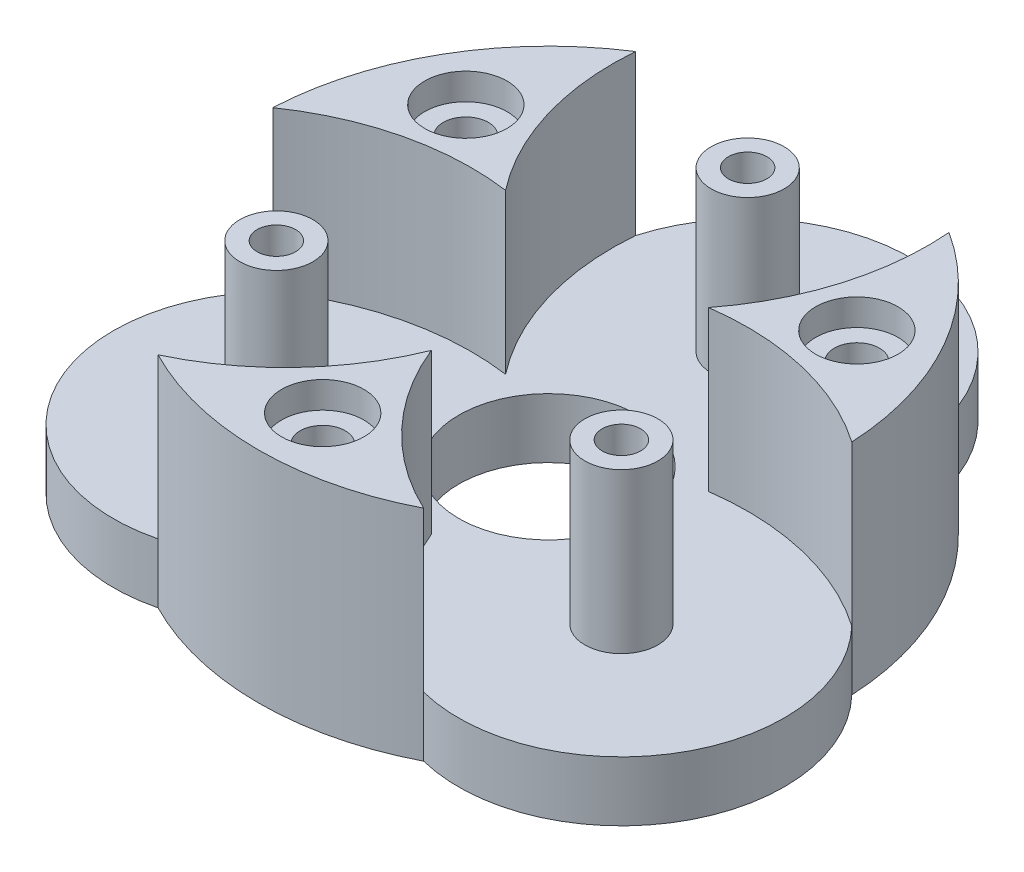
ISO-10303-21;
HEADER;
FILE_DESCRIPTION(('STEP AP214'),'2;1');
FILE_NAME('part.step','',(''),(''),'','','');
FILE_SCHEMA(('AUTOMOTIVE_DESIGN { 1 0 10303 214 1 1 1 1 }'));
ENDSEC;
DATA;
#1=APPLICATION_CONTEXT('core data for automotive mechanical design processes');
#2=APPLICATION_PROTOCOL_DEFINITION('international standard','automotive_design',2000,#1);
#3=PRODUCT_CONTEXT('',#1,'mechanical');
#4=PRODUCT('Part','Part','',(#3));
#5=PRODUCT_RELATED_PRODUCT_CATEGORY('part','',(#4));
#6=PRODUCT_DEFINITION_FORMATION('','',#4);
#7=PRODUCT_DEFINITION_CONTEXT('part definition',#1,'design');
#8=PRODUCT_DEFINITION('design','',#6,#7);
#9=PRODUCT_DEFINITION_SHAPE('','',#8);
#10=(LENGTH_UNIT() NAMED_UNIT(*) SI_UNIT(.MILLI.,.METRE.));
#11=(NAMED_UNIT(*) PLANE_ANGLE_UNIT() SI_UNIT($,.RADIAN.));
#12=(NAMED_UNIT(*) SI_UNIT($,.STERADIAN.) SOLID_ANGLE_UNIT());
#13=UNCERTAINTY_MEASURE_WITH_UNIT(LENGTH_MEASURE(1.E-05),#10,'distance_accuracy_value','');
#14=(GEOMETRIC_REPRESENTATION_CONTEXT(3) GLOBAL_UNCERTAINTY_ASSIGNED_CONTEXT((#13)) GLOBAL_UNIT_ASSIGNED_CONTEXT((#10,
#11,#12)) REPRESENTATION_CONTEXT('',''));
#15=CARTESIAN_POINT('',(0.,0.,0.));
#16=DIRECTION('',(0.,0.,1.));
#17=DIRECTION('',(1.,0.,0.));
#18=AXIS2_PLACEMENT_3D('',#15,#16,#17);
#19=CARTESIAN_POINT('',(-14.7224318643364,-4.80832611206852,-8.49999999999909));
#20=DIRECTION('',(0.,1.,0.));
#21=DIRECTION('',(0.,0.,1.));
#22=AXIS2_PLACEMENT_3D('',#19,#20,#21);
#23=CYLINDRICAL_SURFACE('',#22,1.7);
#24=CARTESIAN_POINT('',(-14.7224318643364,14.5,-8.49999999999909));
#25=DIRECTION('',(0.,1.,0.));
#26=DIRECTION('',(0.,0.,1.));
#27=AXIS2_PLACEMENT_3D('',#24,#25,#26);
#28=CIRCLE('',#27,1.7);
#29=CARTESIAN_POINT('',(-14.7224318643364,14.5,-6.79999999999909));
#30=VERTEX_POINT('',#29);
#31=EDGE_CURVE('E287',#30,#30,#28,.F.);
#32=ORIENTED_EDGE('',*,*,#31,.F.);
#33=EDGE_LOOP('',(#32));
#34=FACE_BOUND('',#33,.T.);
#35=CARTESIAN_POINT('',(-14.7224318643364,3.5,-8.49999999999909));
#36=DIRECTION('',(0.,-1.,0.));
#37=DIRECTION('',(0.,0.,-1.));
#38=AXIS2_PLACEMENT_3D('',#35,#36,#37);
#39=CIRCLE('',#38,1.7);
#40=CARTESIAN_POINT('',(-14.7224318643364,3.5,-10.1999999999991));
#41=VERTEX_POINT('',#40);
#42=EDGE_CURVE('E37',#41,#41,#39,.F.);
#43=ORIENTED_EDGE('',*,*,#42,.F.);
#44=EDGE_LOOP('',(#43));
#45=FACE_BOUND('',#44,.T.);
#46=ADVANCED_FACE('F33',(#34,#45),#23,.F.);
#47=CARTESIAN_POINT('',(14.7224318643351,-4.80832611206852,-8.50000000000133));
#48=DIRECTION('',(0.,1.,0.));
#49=DIRECTION('',(0.,0.,1.));
#50=AXIS2_PLACEMENT_3D('',#47,#48,#49);
#51=CYLINDRICAL_SURFACE('',#50,1.7);
#52=CARTESIAN_POINT('',(14.7224318643351,0.,-8.50000000000133));
#53=DIRECTION('',(0.,1.,0.));
#54=DIRECTION('',(0.,0.,1.));
#55=AXIS2_PLACEMENT_3D('',#52,#53,#54);
#56=CIRCLE('',#55,1.7);
#57=CARTESIAN_POINT('',(14.7224318643351,0.,-6.80000000000134));
#58=VERTEX_POINT('',#57);
#59=EDGE_CURVE('E180',#58,#58,#56,.F.);
#60=ORIENTED_EDGE('',*,*,#59,.T.);
#61=EDGE_LOOP('',(#60));
#62=FACE_BOUND('',#61,.T.);
#63=CARTESIAN_POINT('',(14.7224318643351,14.5,-8.50000000000133));
#64=DIRECTION('',(0.,1.,0.));
#65=DIRECTION('',(0.,0.,1.));
#66=AXIS2_PLACEMENT_3D('',#63,#64,#65);
#67=CIRCLE('',#66,1.7);
#68=CARTESIAN_POINT('',(14.7224318643351,14.5,-6.80000000000134));
#69=VERTEX_POINT('',#68);
#70=EDGE_CURVE('E284',#69,#69,#67,.F.);
#71=ORIENTED_EDGE('',*,*,#70,.F.);
#72=EDGE_LOOP('',(#71));
#73=FACE_BOUND('',#72,.T.);
#74=ADVANCED_FACE('F340',(#62,#73),#51,.F.);
#75=CARTESIAN_POINT('',(1.29150162786473E-12,-4.80832611206852,17.0000000000004));
#76=DIRECTION('',(0.,1.,0.));
#77=DIRECTION('',(0.,0.,1.));
#78=AXIS2_PLACEMENT_3D('',#75,#76,#77);
#79=CYLINDRICAL_SURFACE('',#78,1.7);
#80=CARTESIAN_POINT('',(1.29150162786473E-12,0.,17.0000000000004));
#81=DIRECTION('',(0.,1.,0.));
#82=DIRECTION('',(0.,0.,1.));
#83=AXIS2_PLACEMENT_3D('',#80,#81,#82);
#84=CIRCLE('',#83,1.7);
#85=CARTESIAN_POINT('',(1.29150162786473E-12,0.,18.7000000000004));
#86=VERTEX_POINT('',#85);
#87=EDGE_CURVE('E181',#86,#86,#84,.F.);
#88=ORIENTED_EDGE('',*,*,#87,.T.);
#89=EDGE_LOOP('',(#88));
#90=FACE_BOUND('',#89,.T.);
#91=CARTESIAN_POINT('',(1.29150162786473E-12,14.5,17.0000000000004));
#92=DIRECTION('',(0.,1.,0.));
#93=DIRECTION('',(0.,0.,1.));
#94=AXIS2_PLACEMENT_3D('',#91,#92,#93);
#95=CIRCLE('',#94,1.7);
#96=CARTESIAN_POINT('',(1.29150162786473E-12,14.5,18.7000000000004));
#97=VERTEX_POINT('',#96);
#98=EDGE_CURVE('E281',#97,#97,#95,.F.);
#99=ORIENTED_EDGE('',*,*,#98,.F.);
#100=EDGE_LOOP('',(#99));
#101=FACE_BOUND('',#100,.T.);
#102=ADVANCED_FACE('F348',(#90,#101),#79,.F.);
#103=CARTESIAN_POINT('',(0.,16.5,-15.));
#104=DIRECTION('',(0.,1.,0.));
#105=DIRECTION('',(0.,0.,1.));
#106=AXIS2_PLACEMENT_3D('',#103,#104,#105);
#107=CYLINDRICAL_SURFACE('',#106,1.45);
#108=CARTESIAN_POINT('',(0.,16.5,-15.));
#109=DIRECTION('',(0.,1.,0.));
#110=DIRECTION('',(0.,0.,1.));
#111=AXIS2_PLACEMENT_3D('',#108,#109,#110);
#112=CIRCLE('',#111,1.45);
#113=CARTESIAN_POINT('',(0.,16.5,-13.55));
#114=VERTEX_POINT('',#113);
#115=EDGE_CURVE('E177',#114,#114,#112,.T.);
#116=ORIENTED_EDGE('',*,*,#115,.T.);
#117=EDGE_LOOP('',(#116));
#118=FACE_BOUND('',#117,.T.);
#119=CARTESIAN_POINT('',(0.,2.2,-15.));
#120=DIRECTION('',(0.,-1.,0.));
#121=DIRECTION('',(0.,0.,-1.));
#122=AXIS2_PLACEMENT_3D('',#119,#120,#121);
#123=CIRCLE('',#122,1.45);
#124=CARTESIAN_POINT('',(0.,2.2,-16.45));
#125=VERTEX_POINT('',#124);
#126=EDGE_CURVE('E142',#125,#125,#123,.F.);
#127=ORIENTED_EDGE('',*,*,#126,.F.);
#128=EDGE_LOOP('',(#127));
#129=FACE_BOUND('',#128,.T.);
#130=ADVANCED_FACE('F525',(#118,#129),#107,.F.);
#131=CARTESIAN_POINT('',(-12.9903810567659,16.5,7.50000000000037));
#132=DIRECTION('',(0.,1.,0.));
#133=DIRECTION('',(0.,0.,1.));
#134=AXIS2_PLACEMENT_3D('',#131,#132,#133);
#135=CYLINDRICAL_SURFACE('',#134,1.45);
#136=CARTESIAN_POINT('',(-12.9903810567659,16.5,7.50000000000037));
#137=DIRECTION('',(0.,1.,0.));
#138=DIRECTION('',(0.,0.,1.));
#139=AXIS2_PLACEMENT_3D('',#136,#137,#138);
#140=CIRCLE('',#139,1.45);
#141=CARTESIAN_POINT('',(-12.9903810567659,16.5,8.95000000000037));
#142=VERTEX_POINT('',#141);
#143=EDGE_CURVE('E174',#142,#142,#140,.T.);
#144=ORIENTED_EDGE('',*,*,#143,.T.);
#145=EDGE_LOOP('',(#144));
#146=FACE_BOUND('',#145,.T.);
#147=CARTESIAN_POINT('',(-12.9903810567659,2.2,7.50000000000037));
#148=DIRECTION('',(0.,-1.,0.));
#149=DIRECTION('',(0.,0.,-1.));
#150=AXIS2_PLACEMENT_3D('',#147,#148,#149);
#151=CIRCLE('',#150,1.45);
#152=CARTESIAN_POINT('',(-12.9903810567659,2.2,6.05000000000038));
#153=VERTEX_POINT('',#152);
#154=EDGE_CURVE('E145',#153,#153,#151,.F.);
#155=ORIENTED_EDGE('',*,*,#154,.F.);
#156=EDGE_LOOP('',(#155));
#157=FACE_BOUND('',#156,.T.);
#158=ADVANCED_FACE('F530',(#146,#157),#135,.F.);
#159=CARTESIAN_POINT('',(12.9903810567672,16.5,7.49999999999963));
#160=DIRECTION('',(0.,1.,0.));
#161=DIRECTION('',(0.,0.,1.));
#162=AXIS2_PLACEMENT_3D('',#159,#160,#161);
#163=CYLINDRICAL_SURFACE('',#162,1.45);
#164=CARTESIAN_POINT('',(12.9903810567672,16.5,7.49999999999963));
#165=DIRECTION('',(0.,1.,0.));
#166=DIRECTION('',(0.,0.,1.));
#167=AXIS2_PLACEMENT_3D('',#164,#165,#166);
#168=CIRCLE('',#167,1.45);
#169=CARTESIAN_POINT('',(12.9903810567672,16.5,8.94999999999963));
#170=VERTEX_POINT('',#169);
#171=EDGE_CURVE('E171',#170,#170,#168,.T.);
#172=ORIENTED_EDGE('',*,*,#171,.T.);
#173=EDGE_LOOP('',(#172));
#174=FACE_BOUND('',#173,.T.);
#175=CARTESIAN_POINT('',(12.9903810567672,2.2,7.49999999999963));
#176=DIRECTION('',(0.,-1.,0.));
#177=DIRECTION('',(0.,0.,-1.));
#178=AXIS2_PLACEMENT_3D('',#175,#176,#177);
#179=CIRCLE('',#178,1.45);
#180=CARTESIAN_POINT('',(12.9903810567672,2.2,6.04999999999963));
#181=VERTEX_POINT('',#180);
#182=EDGE_CURVE('E275',#181,#181,#179,.F.);
#183=ORIENTED_EDGE('',*,*,#182,.F.);
#184=EDGE_LOOP('',(#183));
#185=FACE_BOUND('',#184,.T.);
#186=ADVANCED_FACE('F542',(#174,#185),#163,.F.);
#187=CARTESIAN_POINT('',(0.,4.5,0.));
#188=DIRECTION('',(0.,-1.,0.));
#189=DIRECTION('',(0.,0.,-1.));
#190=AXIS2_PLACEMENT_3D('',#187,#188,#189);
#191=CYLINDRICAL_SURFACE('',#190,21.825);
#192=CARTESIAN_POINT('',(0.,0.,0.));
#193=DIRECTION('',(0.,1.,0.));
#194=DIRECTION('',(0.,0.,1.));
#195=AXIS2_PLACEMENT_3D('',#192,#193,#194);
#196=CIRCLE('',#195,21.825);
#197=CARTESIAN_POINT('',(21.8002371635045,0.,-1.03936741095642));
#198=VERTEX_POINT('',#197);
#199=CARTESIAN_POINT('',(11.8002371635036,0.,-18.3598754866439));
#200=VERTEX_POINT('',#199);
#201=EDGE_CURVE('E42',#198,#200,#196,.T.);
#202=ORIENTED_EDGE('',*,*,#201,.T.);
#203=DIRECTION('',(0.,-1.,0.));
#204=VECTOR('',#203,1.);
#205=CARTESIAN_POINT('',(11.8002371635029,29.7261619064555,-18.3598754866443));
#206=LINE('',#205,#204);
#207=CARTESIAN_POINT('',(11.800237163503,4.5,-18.3598754866443));
#208=VERTEX_POINT('',#207);
#209=EDGE_CURVE('E141',#208,#200,#206,.T.);
#210=ORIENTED_EDGE('',*,*,#209,.F.);
#211=DIRECTION('',(0.,-1.,0.));
#212=VECTOR('',#211,1.);
#213=CARTESIAN_POINT('',(11.800237163503,38.8704400804743,-18.3598754866443));
#214=LINE('',#213,#212);
#215=CARTESIAN_POINT('',(11.800237163503,16.5,-18.3598754866443));
#216=VERTEX_POINT('',#215);
#217=EDGE_CURVE('E195',#216,#208,#214,.T.);
#218=ORIENTED_EDGE('',*,*,#217,.F.);
#219=CARTESIAN_POINT('',(0.,16.5,0.));
#220=DIRECTION('',(0.,1.,0.));
#221=DIRECTION('',(0.,0.,1.));
#222=AXIS2_PLACEMENT_3D('',#219,#220,#221);
#223=CIRCLE('',#222,21.825);
#224=CARTESIAN_POINT('',(21.8002371635045,16.5,-1.03936741095635));
#225=VERTEX_POINT('',#224);
#226=EDGE_CURVE('E200',#225,#216,#223,.T.);
#227=ORIENTED_EDGE('',*,*,#226,.F.);
#228=DIRECTION('',(0.,-1.,0.));
#229=VECTOR('',#228,1.);
#230=CARTESIAN_POINT('',(21.8002371635045,38.8704400804743,-1.03936741095636));
#231=LINE('',#230,#229);
#232=CARTESIAN_POINT('',(21.8002371635045,4.5,-1.03936741095635));
#233=VERTEX_POINT('',#232);
#234=EDGE_CURVE('E184',#225,#233,#231,.T.);
#235=ORIENTED_EDGE('',*,*,#234,.T.);
#236=DIRECTION('',(0.,-1.,0.));
#237=VECTOR('',#236,1.);
#238=CARTESIAN_POINT('',(21.8002371635045,30.3041566652598,-1.03936741095642));
#239=LINE('',#238,#237);
#240=EDGE_CURVE('E156',#233,#198,#239,.T.);
#241=ORIENTED_EDGE('',*,*,#240,.T.);
#242=EDGE_LOOP('',(#202,#210,#218,#227,#235,#241));
#243=FACE_BOUND('',#242,.T.);
#244=ADVANCED_FACE('F405',(#243),#191,.T.);
#245=CARTESIAN_POINT('',(-9.99999999999841,0.,19.3992428975987));
#246=VERTEX_POINT('',#245);
#247=CARTESIAN_POINT('',(10.0000000000009,0.,19.3992428975974));
#248=VERTEX_POINT('',#247);
#249=EDGE_CURVE('E11',#246,#248,#196,.T.);
#250=ORIENTED_EDGE('',*,*,#249,.T.);
#251=DIRECTION('',(0.,-1.,0.));
#252=VECTOR('',#251,1.);
#253=CARTESIAN_POINT('',(10.0000000000016,30.3041566652598,19.399242897597));
#254=LINE('',#253,#252);
#255=CARTESIAN_POINT('',(10.0000000000016,4.5,19.399242897597));
#256=VERTEX_POINT('',#255);
#257=EDGE_CURVE('E160',#256,#248,#254,.T.);
#258=ORIENTED_EDGE('',*,*,#257,.F.);
#259=DIRECTION('',(0.,-1.,0.));
#260=VECTOR('',#259,1.);
#261=CARTESIAN_POINT('',(10.0000000000016,40.3537208837531,19.399242897597));
#262=LINE('',#261,#260);
#263=CARTESIAN_POINT('',(10.0000000000016,16.5,19.399242897597));
#264=VERTEX_POINT('',#263);
#265=EDGE_CURVE('E218',#264,#256,#262,.T.);
#266=ORIENTED_EDGE('',*,*,#265,.F.);
#267=CARTESIAN_POINT('',(0.,16.5,0.));
#268=DIRECTION('',(0.,1.,0.));
#269=DIRECTION('',(0.,0.,1.));
#270=AXIS2_PLACEMENT_3D('',#267,#268,#269);
#271=CIRCLE('',#270,21.825);
#272=CARTESIAN_POINT('',(-9.99999999999842,16.5,19.3992428975986));
#273=VERTEX_POINT('',#272);
#274=EDGE_CURVE('E222',#273,#264,#271,.T.);
#275=ORIENTED_EDGE('',*,*,#274,.F.);
#276=DIRECTION('',(0.,-1.,0.));
#277=VECTOR('',#276,1.);
#278=CARTESIAN_POINT('',(-9.99999999999842,40.3537208837531,19.3992428975987));
#279=LINE('',#278,#277);
#280=CARTESIAN_POINT('',(-9.99999999999842,4.5,19.3992428975987));
#281=VERTEX_POINT('',#280);
#282=EDGE_CURVE('E199',#273,#281,#279,.T.);
#283=ORIENTED_EDGE('',*,*,#282,.T.);
#284=DIRECTION('',(0.,-1.,0.));
#285=VECTOR('',#284,1.);
#286=CARTESIAN_POINT('',(-9.99999999999841,30.3041566652593,19.3992428975987));
#287=LINE('',#286,#285);
#288=EDGE_CURVE('E164',#281,#246,#287,.T.);
#289=ORIENTED_EDGE('',*,*,#288,.T.);
#290=EDGE_LOOP('',(#250,#258,#266,#275,#283,#289));
#291=FACE_BOUND('',#290,.T.);
#292=ADVANCED_FACE('F398',(#291),#191,.T.);
#293=CARTESIAN_POINT('',(0.,4.5,0.));
#294=DIRECTION('',(0.,1.,0.));
#295=DIRECTION('',(0.,0.,1.));
#296=AXIS2_PLACEMENT_3D('',#293,#294,#295);
#297=PLANE('',#296);
#298=CARTESIAN_POINT('',(0.,4.5,0.));
#299=DIRECTION('',(0.,1.,0.));
#300=DIRECTION('',(0.,0.,1.));
#301=AXIS2_PLACEMENT_3D('',#298,#299,#300);
#302=CIRCLE('',#301,6.75);
#303=CARTESIAN_POINT('',(0.,4.5,6.75));
#304=VERTEX_POINT('',#303);
#305=EDGE_CURVE('E242',#304,#304,#302,.T.);
#306=ORIENTED_EDGE('',*,*,#305,.F.);
#307=EDGE_LOOP('',(#306));
#308=FACE_BOUND('',#307,.T.);
#309=CARTESIAN_POINT('',(-12.9903810567659,4.5,7.50000000000037));
#310=DIRECTION('',(0.,1.,0.));
#311=DIRECTION('',(0.,0.,1.));
#312=AXIS2_PLACEMENT_3D('',#309,#310,#311);
#313=CIRCLE('',#312,2.75);
#314=CARTESIAN_POINT('',(-12.9903810567659,4.5,10.2500000000004));
#315=VERTEX_POINT('',#314);
#316=EDGE_CURVE('E258',#315,#315,#313,.T.);
#317=ORIENTED_EDGE('',*,*,#316,.F.);
#318=EDGE_LOOP('',(#317));
#319=FACE_BOUND('',#318,.T.);
#320=CARTESIAN_POINT('',(12.9903810567672,4.5,7.49999999999963));
#321=DIRECTION('',(0.,1.,0.));
#322=DIRECTION('',(0.,0.,1.));
#323=AXIS2_PLACEMENT_3D('',#320,#321,#322);
#324=CIRCLE('',#323,2.75);
#325=CARTESIAN_POINT('',(12.9903810567672,4.5,10.2499999999996));
#326=VERTEX_POINT('',#325);
#327=EDGE_CURVE('E262',#326,#326,#324,.T.);
#328=ORIENTED_EDGE('',*,*,#327,.F.);
#329=EDGE_LOOP('',(#328));
#330=FACE_BOUND('',#329,.T.);
#331=CARTESIAN_POINT('',(0.,4.5,-15.));
#332=DIRECTION('',(0.,1.,0.));
#333=DIRECTION('',(0.,0.,1.));
#334=AXIS2_PLACEMENT_3D('',#331,#332,#333);
#335=CIRCLE('',#334,2.75);
#336=CARTESIAN_POINT('',(0.,4.5,-12.25));
#337=VERTEX_POINT('',#336);
#338=EDGE_CURVE('E268',#337,#337,#335,.T.);
#339=ORIENTED_EDGE('',*,*,#338,.F.);
#340=EDGE_LOOP('',(#339));
#341=FACE_BOUND('',#340,.T.);
#342=CARTESIAN_POINT('',(10.4048257460099,4.5,15.3916345964232));
#343=DIRECTION('',(0.,-1.,0.));
#344=DIRECTION('',(0.866025403784441,0.,0.499999999999997));
#345=AXIS2_PLACEMENT_3D('',#342,#343,#344);
#346=CIRCLE('',#345,19.9958302738465);
#347=CARTESIAN_POINT('',(7.64267418839752,4.5,-4.41250000000025));
#348=VERTEX_POINT('',#347);
#349=EDGE_CURVE('E187',#348,#233,#346,.T.);
#350=ORIENTED_EDGE('',*,*,#349,.F.);
#351=CARTESIAN_POINT('',(-8.12713369326764,4.5,-16.706660716204));
#352=DIRECTION('',(0.,-1.,0.));
#353=DIRECTION('',(-0.866025403784441,0.,-0.499999999999997));
#354=AXIS2_PLACEMENT_3D('',#351,#352,#353);
#355=CIRCLE('',#354,19.9958302738465);
#356=EDGE_CURVE('E192',#208,#348,#355,.T.);
#357=ORIENTED_EDGE('',*,*,#356,.F.);
#358=CARTESIAN_POINT('',(-7.84095011141517E-13,4.5,-14.9999999999996));
#359=DIRECTION('',(0.,1.,0.));
#360=DIRECTION('',(0.,0.,1.));
#361=AXIS2_PLACEMENT_3D('',#358,#359,#360);
#362=CIRCLE('',#361,12.2692444918464);
#363=CARTESIAN_POINT('',(-11.800237163506,4.5,-18.3598754866424));
#364=VERTEX_POINT('',#363);
#365=EDGE_CURVE('E138',#364,#208,#362,.F.);
#366=ORIENTED_EDGE('',*,*,#365,.F.);
#367=CARTESIAN_POINT('',(8.12713369326501,4.5,-16.7066607162065));
#368=DIRECTION('',(0.,-1.,0.));
#369=DIRECTION('',(0.,0.,-1.));
#370=AXIS2_PLACEMENT_3D('',#367,#368,#369);
#371=CIRCLE('',#370,19.9958302738465);
#372=CARTESIAN_POINT('',(-7.64267418839779,4.5,-4.41249999999977));
#373=VERTEX_POINT('',#372);
#374=EDGE_CURVE('E232',#373,#364,#371,.T.);
#375=ORIENTED_EDGE('',*,*,#374,.F.);
#376=CARTESIAN_POINT('',(-10.4048257460064,4.5,15.3916345964242));
#377=DIRECTION('',(0.,-1.,0.));
#378=DIRECTION('',(0.,0.,1.));
#379=AXIS2_PLACEMENT_3D('',#376,#377,#378);
#380=CIRCLE('',#379,19.9958302738465);
#381=CARTESIAN_POINT('',(-21.8002371635047,4.5,-1.0393674109528));
#382=VERTEX_POINT('',#381);
#383=EDGE_CURVE('E236',#382,#373,#380,.T.);
#384=ORIENTED_EDGE('',*,*,#383,.F.);
#385=CARTESIAN_POINT('',(-12.9903810567659,4.5,7.50000000000037));
#386=DIRECTION('',(0.,1.,0.));
#387=DIRECTION('',(0.,0.,1.));
#388=AXIS2_PLACEMENT_3D('',#385,#386,#387);
#389=CIRCLE('',#388,12.2692444918464);
#390=EDGE_CURVE('E165',#281,#382,#389,.F.);
#391=ORIENTED_EDGE('',*,*,#390,.F.);
#392=CARTESIAN_POINT('',(-18.5319594392749,4.5,1.31502611978334));
#393=DIRECTION('',(0.,-1.,0.));
#394=DIRECTION('',(-0.866025403784438,0.,0.500000000000002));
#395=AXIS2_PLACEMENT_3D('',#392,#393,#394);
#396=CIRCLE('',#395,19.9958302738465);
#397=CARTESIAN_POINT('',(2.74086309204336E-13,4.5,8.825));
#398=VERTEX_POINT('',#397);
#399=EDGE_CURVE('E210',#398,#281,#396,.T.);
#400=ORIENTED_EDGE('',*,*,#399,.F.);
#401=CARTESIAN_POINT('',(18.531959439274,4.5,1.3150261197798));
#402=DIRECTION('',(0.,-1.,0.));
#403=DIRECTION('',(0.866025403784438,0.,-0.500000000000002));
#404=AXIS2_PLACEMENT_3D('',#401,#402,#403);
#405=CIRCLE('',#404,19.9958302738465);
#406=EDGE_CURVE('E215',#256,#398,#405,.T.);
#407=ORIENTED_EDGE('',*,*,#406,.F.);
#408=CARTESIAN_POINT('',(12.9903810567666,4.5,7.4999999999992));
#409=DIRECTION('',(0.,1.,0.));
#410=DIRECTION('',(0.,0.,1.));
#411=AXIS2_PLACEMENT_3D('',#408,#409,#410);
#412=CIRCLE('',#411,12.2692444918464);
#413=EDGE_CURVE('E157',#233,#256,#412,.F.);
#414=ORIENTED_EDGE('',*,*,#413,.F.);
#415=EDGE_LOOP('',(#350,#357,#366,#375,#384,#391,#400,#407,#414));
#416=FACE_BOUND('',#415,.T.);
#417=ADVANCED_FACE('F396',(#308,#319,#330,#341,#416),#297,.T.);
#418=DIRECTION('',(0.,-1.,0.));
#419=VECTOR('',#418,1.);
#420=CARTESIAN_POINT('',(-11.800237163506,38.8704400804755,-18.3598754866424));
#421=LINE('',#420,#419);
#422=CARTESIAN_POINT('',(-11.800237163506,16.5,-18.3598754866424));
#423=VERTEX_POINT('',#422);
#424=EDGE_CURVE('E134',#423,#364,#421,.T.);
#425=ORIENTED_EDGE('',*,*,#424,.T.);
#426=DIRECTION('',(0.,-1.,0.));
#427=VECTOR('',#426,1.);
#428=CARTESIAN_POINT('',(-11.8002371635062,29.7261619064555,-18.3598754866422));
#429=LINE('',#428,#427);
#430=CARTESIAN_POINT('',(-11.8002371635062,0.,-18.3598754866422));
#431=VERTEX_POINT('',#430);
#432=EDGE_CURVE('E132',#364,#431,#429,.T.);
#433=ORIENTED_EDGE('',*,*,#432,.T.);
#434=CARTESIAN_POINT('',(-21.8002371635046,0.,-1.03936741095362));
#435=VERTEX_POINT('',#434);
#436=EDGE_CURVE('E44',#431,#435,#196,.T.);
#437=ORIENTED_EDGE('',*,*,#436,.T.);
#438=DIRECTION('',(0.,-1.,0.));
#439=VECTOR('',#438,1.);
#440=CARTESIAN_POINT('',(-21.8002371635047,30.3041566652593,-1.0393674109528));
#441=LINE('',#440,#439);
#442=EDGE_CURVE('E168',#382,#435,#441,.T.);
#443=ORIENTED_EDGE('',*,*,#442,.F.);
#444=DIRECTION('',(0.,-1.,0.));
#445=VECTOR('',#444,1.);
#446=CARTESIAN_POINT('',(-21.8002371635047,38.8704400804755,-1.0393674109528));
#447=LINE('',#446,#445);
#448=CARTESIAN_POINT('',(-21.8002371635047,16.5,-1.0393674109528));
#449=VERTEX_POINT('',#448);
#450=EDGE_CURVE('E238',#449,#382,#447,.T.);
#451=ORIENTED_EDGE('',*,*,#450,.F.);
#452=CARTESIAN_POINT('',(0.,16.5,0.));
#453=DIRECTION('',(0.,1.,0.));
#454=DIRECTION('',(0.,0.,1.));
#455=AXIS2_PLACEMENT_3D('',#452,#453,#454);
#456=CIRCLE('',#455,21.825);
#457=EDGE_CURVE('E243',#423,#449,#456,.T.);
#458=ORIENTED_EDGE('',*,*,#457,.F.);
#459=EDGE_LOOP('',(#425,#433,#437,#443,#451,#458));
#460=FACE_BOUND('',#459,.T.);
#461=ADVANCED_FACE('F35',(#460),#191,.T.);
#462=CARTESIAN_POINT('',(0.,0.,0.));
#463=DIRECTION('',(0.,1.,0.));
#464=DIRECTION('',(0.,0.,1.));
#465=AXIS2_PLACEMENT_3D('',#462,#463,#464);
#466=PLANE('',#465);
#467=CARTESIAN_POINT('',(-14.7224318643364,0.,-8.49999999999909));
#468=DIRECTION('',(0.,-1.,0.));
#469=DIRECTION('',(0.,0.,-1.));
#470=AXIS2_PLACEMENT_3D('',#467,#468,#469);
#471=CIRCLE('',#470,3.1);
#472=CARTESIAN_POINT('',(-14.7224318643364,0.,-11.5999999999991));
#473=VERTEX_POINT('',#472);
#474=EDGE_CURVE('E327',#473,#473,#471,.T.);
#475=ORIENTED_EDGE('',*,*,#474,.F.);
#476=EDGE_LOOP('',(#475));
#477=FACE_BOUND('',#476,.T.);
#478=CARTESIAN_POINT('',(-12.9903810567659,0.,7.50000000000037));
#479=DIRECTION('',(0.,-1.,0.));
#480=DIRECTION('',(0.,0.,-1.));
#481=AXIS2_PLACEMENT_3D('',#478,#479,#480);
#482=CIRCLE('',#481,2.875);
#483=CARTESIAN_POINT('',(-12.9903810567659,0.,4.62500000000037));
#484=VERTEX_POINT('',#483);
#485=EDGE_CURVE('E305',#484,#484,#482,.T.);
#486=ORIENTED_EDGE('',*,*,#485,.F.);
#487=EDGE_LOOP('',(#486));
#488=FACE_BOUND('',#487,.T.);
#489=CARTESIAN_POINT('',(12.9903810567666,0.,7.50000000000037));
#490=DIRECTION('',(0.,-1.,0.));
#491=DIRECTION('',(0.,0.,-1.));
#492=AXIS2_PLACEMENT_3D('',#489,#490,#491);
#493=CIRCLE('',#492,2.87500000000113);
#494=CARTESIAN_POINT('',(12.9903810567666,0.,4.62499999999924));
#495=VERTEX_POINT('',#494);
#496=EDGE_CURVE('E296',#495,#495,#493,.T.);
#497=ORIENTED_EDGE('',*,*,#496,.F.);
#498=EDGE_LOOP('',(#497));
#499=FACE_BOUND('',#498,.T.);
#500=CARTESIAN_POINT('',(3.19241253223778E-13,0.,-14.9999999999991));
#501=DIRECTION('',(0.,-1.,0.));
#502=DIRECTION('',(0.,0.,-1.));
#503=AXIS2_PLACEMENT_3D('',#500,#501,#502);
#504=CIRCLE('',#503,2.87500000000044);
#505=CARTESIAN_POINT('',(3.19241253223778E-13,0.,-17.8749999999995));
#506=VERTEX_POINT('',#505);
#507=EDGE_CURVE('E149',#506,#506,#504,.T.);
#508=ORIENTED_EDGE('',*,*,#507,.F.);
#509=EDGE_LOOP('',(#508));
#510=FACE_BOUND('',#509,.T.);
#511=ORIENTED_EDGE('',*,*,#87,.F.);
#512=EDGE_LOOP('',(#511));
#513=FACE_BOUND('',#512,.T.);
#514=ORIENTED_EDGE('',*,*,#59,.F.);
#515=EDGE_LOOP('',(#514));
#516=FACE_BOUND('',#515,.T.);
#517=CARTESIAN_POINT('',(0.,0.,0.));
#518=DIRECTION('',(0.,1.,0.));
#519=DIRECTION('',(0.,0.,1.));
#520=AXIS2_PLACEMENT_3D('',#517,#518,#519);
#521=CIRCLE('',#520,6.75);
#522=CARTESIAN_POINT('',(0.,0.,6.75));
#523=VERTEX_POINT('',#522);
#524=EDGE_CURVE('E255',#523,#523,#521,.T.);
#525=ORIENTED_EDGE('',*,*,#524,.T.);
#526=EDGE_LOOP('',(#525));
#527=FACE_BOUND('',#526,.T.);
#528=ORIENTED_EDGE('',*,*,#249,.F.);
#529=CARTESIAN_POINT('',(-12.9903810567659,0.,7.50000000000037));
#530=DIRECTION('',(0.,-1.,0.));
#531=DIRECTION('',(0.,0.,1.));
#532=AXIS2_PLACEMENT_3D('',#529,#530,#531);
#533=CIRCLE('',#532,12.2692444918464);
#534=EDGE_CURVE('E127',#246,#435,#533,.T.);
#535=ORIENTED_EDGE('',*,*,#534,.T.);
#536=ORIENTED_EDGE('',*,*,#436,.F.);
#537=CARTESIAN_POINT('',(-7.84095011141517E-13,0.,-14.9999999999996));
#538=DIRECTION('',(0.,-1.,0.));
#539=DIRECTION('',(-0.866025403784443,0.,-0.499999999999992));
#540=AXIS2_PLACEMENT_3D('',#537,#538,#539);
#541=CIRCLE('',#540,12.2692444918464);
#542=EDGE_CURVE('E125',#431,#200,#541,.T.);
#543=ORIENTED_EDGE('',*,*,#542,.T.);
#544=ORIENTED_EDGE('',*,*,#201,.F.);
#545=CARTESIAN_POINT('',(12.9903810567666,0.,7.4999999999992));
#546=DIRECTION('',(0.,-1.,0.));
#547=DIRECTION('',(0.866025403784436,0.,-0.500000000000004));
#548=AXIS2_PLACEMENT_3D('',#545,#546,#547);
#549=CIRCLE('',#548,12.2692444918464);
#550=EDGE_CURVE('E153',#198,#248,#549,.T.);
#551=ORIENTED_EDGE('',*,*,#550,.T.);
#552=EDGE_LOOP('',(#528,#535,#536,#543,#544,#551));
#553=FACE_BOUND('',#552,.T.);
#554=ADVANCED_FACE('F123',(#477,#488,#499,#510,#513,#516,#527,#553),#466,.F.);
#555=CARTESIAN_POINT('',(0.,16.5,-15.));
#556=DIRECTION('',(0.,-1.,0.));
#557=DIRECTION('',(0.,0.,-1.));
#558=AXIS2_PLACEMENT_3D('',#555,#556,#557);
#559=CYLINDRICAL_SURFACE('',#558,2.75);
#560=CARTESIAN_POINT('',(0.,16.5,-15.));
#561=DIRECTION('',(0.,1.,0.));
#562=DIRECTION('',(0.,0.,1.));
#563=AXIS2_PLACEMENT_3D('',#560,#561,#562);
#564=CIRCLE('',#563,2.75);
#565=CARTESIAN_POINT('',(0.,16.5,-12.25));
#566=VERTEX_POINT('',#565);
#567=EDGE_CURVE('E130',#566,#566,#564,.T.);
#568=ORIENTED_EDGE('',*,*,#567,.F.);
#569=EDGE_LOOP('',(#568));
#570=FACE_BOUND('',#569,.T.);
#571=ORIENTED_EDGE('',*,*,#338,.T.);
#572=EDGE_LOOP('',(#571));
#573=FACE_BOUND('',#572,.T.);
#574=ADVANCED_FACE('F391',(#570,#573),#559,.T.);
#575=CARTESIAN_POINT('',(0.,16.5,-15.));
#576=DIRECTION('',(0.,1.,0.));
#577=DIRECTION('',(0.,0.,1.));
#578=AXIS2_PLACEMENT_3D('',#575,#576,#577);
#579=PLANE('',#578);
#580=ORIENTED_EDGE('',*,*,#115,.F.);
#581=EDGE_LOOP('',(#580));
#582=FACE_BOUND('',#581,.T.);
#583=ORIENTED_EDGE('',*,*,#567,.T.);
#584=EDGE_LOOP('',(#583));
#585=FACE_BOUND('',#584,.T.);
#586=ADVANCED_FACE('F387',(#582,#585),#579,.T.);
#587=CARTESIAN_POINT('',(12.9903810567672,16.5,7.49999999999963));
#588=DIRECTION('',(0.,-1.,0.));
#589=DIRECTION('',(0.,0.,-1.));
#590=AXIS2_PLACEMENT_3D('',#587,#588,#589);
#591=CYLINDRICAL_SURFACE('',#590,2.75);
#592=CARTESIAN_POINT('',(12.9903810567672,16.5,7.49999999999963));
#593=DIRECTION('',(0.,1.,0.));
#594=DIRECTION('',(0.,0.,1.));
#595=AXIS2_PLACEMENT_3D('',#592,#593,#594);
#596=CIRCLE('',#595,2.75);
#597=CARTESIAN_POINT('',(12.9903810567672,16.5,10.2499999999996));
#598=VERTEX_POINT('',#597);
#599=EDGE_CURVE('E265',#598,#598,#596,.T.);
#600=ORIENTED_EDGE('',*,*,#599,.F.);
#601=EDGE_LOOP('',(#600));
#602=FACE_BOUND('',#601,.T.);
#603=ORIENTED_EDGE('',*,*,#327,.T.);
#604=EDGE_LOOP('',(#603));
#605=FACE_BOUND('',#604,.T.);
#606=ADVANCED_FACE('F383',(#602,#605),#591,.T.);
#607=CARTESIAN_POINT('',(12.9903810567672,16.5,7.49999999999963));
#608=DIRECTION('',(0.,1.,0.));
#609=DIRECTION('',(0.,0.,1.));
#610=AXIS2_PLACEMENT_3D('',#607,#608,#609);
#611=PLANE('',#610);
#612=ORIENTED_EDGE('',*,*,#171,.F.);
#613=EDGE_LOOP('',(#612));
#614=FACE_BOUND('',#613,.T.);
#615=ORIENTED_EDGE('',*,*,#599,.T.);
#616=EDGE_LOOP('',(#615));
#617=FACE_BOUND('',#616,.T.);
#618=ADVANCED_FACE('F379',(#614,#617),#611,.T.);
#619=CARTESIAN_POINT('',(-12.9903810567659,16.5,7.50000000000037));
#620=DIRECTION('',(0.,-1.,0.));
#621=DIRECTION('',(0.,0.,-1.));
#622=AXIS2_PLACEMENT_3D('',#619,#620,#621);
#623=CYLINDRICAL_SURFACE('',#622,2.75);
#624=CARTESIAN_POINT('',(-12.9903810567659,16.5,7.50000000000037));
#625=DIRECTION('',(0.,1.,0.));
#626=DIRECTION('',(0.,0.,1.));
#627=AXIS2_PLACEMENT_3D('',#624,#625,#626);
#628=CIRCLE('',#627,2.75);
#629=CARTESIAN_POINT('',(-12.9903810567659,16.5,10.2500000000004));
#630=VERTEX_POINT('',#629);
#631=EDGE_CURVE('E259',#630,#630,#628,.T.);
#632=ORIENTED_EDGE('',*,*,#631,.F.);
#633=EDGE_LOOP('',(#632));
#634=FACE_BOUND('',#633,.T.);
#635=ORIENTED_EDGE('',*,*,#316,.T.);
#636=EDGE_LOOP('',(#635));
#637=FACE_BOUND('',#636,.T.);
#638=ADVANCED_FACE('F375',(#634,#637),#623,.T.);
#639=CARTESIAN_POINT('',(-12.9903810567659,16.5,7.50000000000037));
#640=DIRECTION('',(0.,1.,0.));
#641=DIRECTION('',(0.,0.,1.));
#642=AXIS2_PLACEMENT_3D('',#639,#640,#641);
#643=PLANE('',#642);
#644=ORIENTED_EDGE('',*,*,#143,.F.);
#645=EDGE_LOOP('',(#644));
#646=FACE_BOUND('',#645,.T.);
#647=ORIENTED_EDGE('',*,*,#631,.T.);
#648=EDGE_LOOP('',(#647));
#649=FACE_BOUND('',#648,.T.);
#650=ADVANCED_FACE('F371',(#646,#649),#643,.T.);
#651=CARTESIAN_POINT('',(0.,4.5,0.));
#652=DIRECTION('',(0.,1.,0.));
#653=DIRECTION('',(0.,0.,1.));
#654=AXIS2_PLACEMENT_3D('',#651,#652,#653);
#655=CYLINDRICAL_SURFACE('',#654,6.75);
#656=ORIENTED_EDGE('',*,*,#524,.F.);
#657=EDGE_LOOP('',(#656));
#658=FACE_BOUND('',#657,.T.);
#659=ORIENTED_EDGE('',*,*,#305,.T.);
#660=EDGE_LOOP('',(#659));
#661=FACE_BOUND('',#660,.T.);
#662=ADVANCED_FACE('F363',(#658,#661),#655,.F.);
#663=CARTESIAN_POINT('',(-10.4048257460064,38.8704400804755,15.3916345964242));
#664=DIRECTION('',(0.,-1.,0.));
#665=DIRECTION('',(0.,0.,-1.));
#666=AXIS2_PLACEMENT_3D('',#663,#664,#665);
#667=CYLINDRICAL_SURFACE('',#666,19.9958302738465);
#668=CARTESIAN_POINT('',(-10.4048257460064,16.5,15.3916345964242));
#669=DIRECTION('',(0.,1.,0.));
#670=DIRECTION('',(0.,0.,1.));
#671=AXIS2_PLACEMENT_3D('',#668,#669,#670);
#672=CIRCLE('',#671,19.9958302738465);
#673=CARTESIAN_POINT('',(-7.64267418839779,16.5,-4.41249999999977));
#674=VERTEX_POINT('',#673);
#675=EDGE_CURVE('E239',#449,#674,#672,.F.);
#676=ORIENTED_EDGE('',*,*,#675,.F.);
#677=ORIENTED_EDGE('',*,*,#450,.T.);
#678=ORIENTED_EDGE('',*,*,#383,.T.);
#679=DIRECTION('',(0.,-1.,0.));
#680=VECTOR('',#679,1.);
#681=CARTESIAN_POINT('',(-7.64267418839779,38.8704400804755,-4.41249999999977));
#682=LINE('',#681,#680);
#683=EDGE_CURVE('E235',#674,#373,#682,.T.);
#684=ORIENTED_EDGE('',*,*,#683,.F.);
#685=EDGE_LOOP('',(#676,#677,#678,#684));
#686=FACE_BOUND('',#685,.T.);
#687=ADVANCED_FACE('F359',(#686),#667,.F.);
#688=CARTESIAN_POINT('',(8.12713369326501,38.8704400804755,-16.7066607162065));
#689=DIRECTION('',(0.,-1.,0.));
#690=DIRECTION('',(0.,0.,-1.));
#691=AXIS2_PLACEMENT_3D('',#688,#689,#690);
#692=CYLINDRICAL_SURFACE('',#691,19.9958302738465);
#693=CARTESIAN_POINT('',(8.12713369326501,16.5,-16.7066607162065));
#694=DIRECTION('',(0.,1.,0.));
#695=DIRECTION('',(0.,0.,1.));
#696=AXIS2_PLACEMENT_3D('',#693,#694,#695);
#697=CIRCLE('',#696,19.9958302738465);
#698=EDGE_CURVE('E234',#674,#423,#697,.F.);
#699=ORIENTED_EDGE('',*,*,#698,.F.);
#700=ORIENTED_EDGE('',*,*,#683,.T.);
#701=ORIENTED_EDGE('',*,*,#374,.T.);
#702=ORIENTED_EDGE('',*,*,#424,.F.);
#703=EDGE_LOOP('',(#699,#700,#701,#702));
#704=FACE_BOUND('',#703,.T.);
#705=ADVANCED_FACE('F355',(#704),#692,.F.);
#706=CARTESIAN_POINT('',(-12.9903810567659,16.5,7.50000000000037));
#707=DIRECTION('',(0.,1.,0.));
#708=DIRECTION('',(0.,0.,1.));
#709=AXIS2_PLACEMENT_3D('',#706,#707,#708);
#710=PLANE('',#709);
#711=CARTESIAN_POINT('',(-14.7224318643364,16.5,-8.49999999999913));
#712=DIRECTION('',(0.,1.,0.));
#713=DIRECTION('',(0.,0.,1.));
#714=AXIS2_PLACEMENT_3D('',#711,#712,#713);
#715=CIRCLE('',#714,3.1);
#716=CARTESIAN_POINT('',(-14.7224318643364,16.5,-5.39999999999914));
#717=VERTEX_POINT('',#716);
#718=EDGE_CURVE('E316',#717,#717,#715,.T.);
#719=ORIENTED_EDGE('',*,*,#718,.F.);
#720=EDGE_LOOP('',(#719));
#721=FACE_BOUND('',#720,.T.);
#722=ORIENTED_EDGE('',*,*,#698,.T.);
#723=ORIENTED_EDGE('',*,*,#457,.T.);
#724=ORIENTED_EDGE('',*,*,#675,.T.);
#725=EDGE_LOOP('',(#722,#723,#724));
#726=FACE_BOUND('',#725,.T.);
#727=ADVANCED_FACE('F358',(#721,#726),#710,.T.);
#728=CARTESIAN_POINT('',(18.531959439274,40.3537208837531,1.3150261197798));
#729=DIRECTION('',(0.,-1.,0.));
#730=DIRECTION('',(0.,0.,-1.));
#731=AXIS2_PLACEMENT_3D('',#728,#729,#730);
#732=CYLINDRICAL_SURFACE('',#731,19.9958302738465);
#733=CARTESIAN_POINT('',(18.531959439274,16.5,1.3150261197798));
#734=DIRECTION('',(0.,1.,0.));
#735=DIRECTION('',(0.,0.,1.));
#736=AXIS2_PLACEMENT_3D('',#733,#734,#735);
#737=CIRCLE('',#736,19.9958302738465);
#738=CARTESIAN_POINT('',(2.74086309204336E-13,16.5,8.825));
#739=VERTEX_POINT('',#738);
#740=EDGE_CURVE('E219',#264,#739,#737,.F.);
#741=ORIENTED_EDGE('',*,*,#740,.F.);
#742=ORIENTED_EDGE('',*,*,#265,.T.);
#743=ORIENTED_EDGE('',*,*,#406,.T.);
#744=DIRECTION('',(0.,-1.,0.));
#745=VECTOR('',#744,1.);
#746=CARTESIAN_POINT('',(2.74086309204336E-13,40.3537208837531,8.825));
#747=LINE('',#746,#745);
#748=EDGE_CURVE('E214',#739,#398,#747,.T.);
#749=ORIENTED_EDGE('',*,*,#748,.F.);
#750=EDGE_LOOP('',(#741,#742,#743,#749));
#751=FACE_BOUND('',#750,.T.);
#752=ADVANCED_FACE('F367',(#751),#732,.F.);
#753=CARTESIAN_POINT('',(-18.5319594392749,40.3537208837531,1.31502611978334));
#754=DIRECTION('',(0.,-1.,0.));
#755=DIRECTION('',(0.,0.,-1.));
#756=AXIS2_PLACEMENT_3D('',#753,#754,#755);
#757=CYLINDRICAL_SURFACE('',#756,19.9958302738465);
#758=CARTESIAN_POINT('',(-18.5319594392749,16.5,1.31502611978334));
#759=DIRECTION('',(0.,1.,0.));
#760=DIRECTION('',(0.,0.,1.));
#761=AXIS2_PLACEMENT_3D('',#758,#759,#760);
#762=CIRCLE('',#761,19.9958302738465);
#763=EDGE_CURVE('E213',#739,#273,#762,.F.);
#764=ORIENTED_EDGE('',*,*,#763,.F.);
#765=ORIENTED_EDGE('',*,*,#748,.T.);
#766=ORIENTED_EDGE('',*,*,#399,.T.);
#767=ORIENTED_EDGE('',*,*,#282,.F.);
#768=EDGE_LOOP('',(#764,#765,#766,#767));
#769=FACE_BOUND('',#768,.T.);
#770=ADVANCED_FACE('F450',(#769),#757,.F.);
#771=CARTESIAN_POINT('',(-12.9903810567659,16.5,7.50000000000037));
#772=DIRECTION('',(0.,1.,0.));
#773=DIRECTION('',(0.,0.,1.));
#774=AXIS2_PLACEMENT_3D('',#771,#772,#773);
#775=PLANE('',#774);
#776=CARTESIAN_POINT('',(1.29150162786473E-12,16.5,17.0000000000004));
#777=DIRECTION('',(0.,1.,0.));
#778=DIRECTION('',(0.,0.,1.));
#779=AXIS2_PLACEMENT_3D('',#776,#777,#778);
#780=CIRCLE('',#779,3.1);
#781=CARTESIAN_POINT('',(1.29150162786473E-12,16.5,20.1000000000004));
#782=VERTEX_POINT('',#781);
#783=EDGE_CURVE('E322',#782,#782,#780,.T.);
#784=ORIENTED_EDGE('',*,*,#783,.F.);
#785=EDGE_LOOP('',(#784));
#786=FACE_BOUND('',#785,.T.);
#787=ORIENTED_EDGE('',*,*,#763,.T.);
#788=ORIENTED_EDGE('',*,*,#274,.T.);
#789=ORIENTED_EDGE('',*,*,#740,.T.);
#790=EDGE_LOOP('',(#787,#788,#789));
#791=FACE_BOUND('',#790,.T.);
#792=ADVANCED_FACE('F353',(#786,#791),#775,.T.);
#793=CARTESIAN_POINT('',(-8.12713369326764,38.8704400804743,-16.706660716204));
#794=DIRECTION('',(0.,-1.,0.));
#795=DIRECTION('',(0.,0.,-1.));
#796=AXIS2_PLACEMENT_3D('',#793,#794,#795);
#797=CYLINDRICAL_SURFACE('',#796,19.9958302738465);
#798=CARTESIAN_POINT('',(-8.12713369326764,16.5,-16.706660716204));
#799=DIRECTION('',(0.,1.,0.));
#800=DIRECTION('',(0.,0.,1.));
#801=AXIS2_PLACEMENT_3D('',#798,#799,#800);
#802=CIRCLE('',#801,19.9958302738465);
#803=CARTESIAN_POINT('',(7.64267418839752,16.5,-4.41250000000025));
#804=VERTEX_POINT('',#803);
#805=EDGE_CURVE('E196',#216,#804,#802,.F.);
#806=ORIENTED_EDGE('',*,*,#805,.F.);
#807=ORIENTED_EDGE('',*,*,#217,.T.);
#808=ORIENTED_EDGE('',*,*,#356,.T.);
#809=DIRECTION('',(0.,-1.,0.));
#810=VECTOR('',#809,1.);
#811=CARTESIAN_POINT('',(7.64267418839752,38.8704400804743,-4.41250000000025));
#812=LINE('',#811,#810);
#813=EDGE_CURVE('E191',#804,#348,#812,.T.);
#814=ORIENTED_EDGE('',*,*,#813,.F.);
#815=EDGE_LOOP('',(#806,#807,#808,#814));
#816=FACE_BOUND('',#815,.T.);
#817=ADVANCED_FACE('F436',(#816),#797,.F.);
#818=CARTESIAN_POINT('',(10.4048257460099,38.8704400804743,15.3916345964232));
#819=DIRECTION('',(0.,-1.,0.));
#820=DIRECTION('',(0.,0.,-1.));
#821=AXIS2_PLACEMENT_3D('',#818,#819,#820);
#822=CYLINDRICAL_SURFACE('',#821,19.9958302738465);
#823=CARTESIAN_POINT('',(10.4048257460099,16.5,15.3916345964232));
#824=DIRECTION('',(0.,1.,0.));
#825=DIRECTION('',(0.,0.,1.));
#826=AXIS2_PLACEMENT_3D('',#823,#824,#825);
#827=CIRCLE('',#826,19.9958302738465);
#828=EDGE_CURVE('E190',#804,#225,#827,.F.);
#829=ORIENTED_EDGE('',*,*,#828,.F.);
#830=ORIENTED_EDGE('',*,*,#813,.T.);
#831=ORIENTED_EDGE('',*,*,#349,.T.);
#832=ORIENTED_EDGE('',*,*,#234,.F.);
#833=EDGE_LOOP('',(#829,#830,#831,#832));
#834=FACE_BOUND('',#833,.T.);
#835=ADVANCED_FACE('F434',(#834),#822,.F.);
#836=CARTESIAN_POINT('',(-12.9903810567659,16.5,7.50000000000037));
#837=DIRECTION('',(0.,1.,0.));
#838=DIRECTION('',(0.,0.,1.));
#839=AXIS2_PLACEMENT_3D('',#836,#837,#838);
#840=PLANE('',#839);
#841=CARTESIAN_POINT('',(14.7224318643352,16.5,-8.50000000000116));
#842=DIRECTION('',(0.,1.,0.));
#843=DIRECTION('',(0.,0.,1.));
#844=AXIS2_PLACEMENT_3D('',#841,#842,#843);
#845=CIRCLE('',#844,3.1);
#846=CARTESIAN_POINT('',(14.7224318643352,16.5,-5.40000000000116));
#847=VERTEX_POINT('',#846);
#848=EDGE_CURVE('E310',#847,#847,#845,.T.);
#849=ORIENTED_EDGE('',*,*,#848,.F.);
#850=EDGE_LOOP('',(#849));
#851=FACE_BOUND('',#850,.T.);
#852=ORIENTED_EDGE('',*,*,#828,.T.);
#853=ORIENTED_EDGE('',*,*,#226,.T.);
#854=ORIENTED_EDGE('',*,*,#805,.T.);
#855=EDGE_LOOP('',(#852,#853,#854));
#856=FACE_BOUND('',#855,.T.);
#857=ADVANCED_FACE('F458',(#851,#856),#840,.T.);
#858=CARTESIAN_POINT('',(-12.9903810567659,30.3041566652593,7.50000000000037));
#859=DIRECTION('',(0.,-1.,0.));
#860=DIRECTION('',(0.,0.,-1.));
#861=AXIS2_PLACEMENT_3D('',#858,#859,#860);
#862=CYLINDRICAL_SURFACE('',#861,12.2692444918464);
#863=ORIENTED_EDGE('',*,*,#288,.F.);
#864=ORIENTED_EDGE('',*,*,#390,.T.);
#865=ORIENTED_EDGE('',*,*,#442,.T.);
#866=ORIENTED_EDGE('',*,*,#534,.F.);
#867=EDGE_LOOP('',(#863,#864,#865,#866));
#868=FACE_BOUND('',#867,.T.);
#869=ADVANCED_FACE('F447',(#868),#862,.T.);
#870=CARTESIAN_POINT('',(12.9903810567666,30.3041566652598,7.4999999999992));
#871=DIRECTION('',(0.,-1.,0.));
#872=DIRECTION('',(0.,0.,-1.));
#873=AXIS2_PLACEMENT_3D('',#870,#871,#872);
#874=CYLINDRICAL_SURFACE('',#873,12.2692444918464);
#875=ORIENTED_EDGE('',*,*,#240,.F.);
#876=ORIENTED_EDGE('',*,*,#413,.T.);
#877=ORIENTED_EDGE('',*,*,#257,.T.);
#878=ORIENTED_EDGE('',*,*,#550,.F.);
#879=EDGE_LOOP('',(#875,#876,#877,#878));
#880=FACE_BOUND('',#879,.T.);
#881=ADVANCED_FACE('F455',(#880),#874,.T.);
#882=CARTESIAN_POINT('',(-7.84095011141517E-13,29.7261619064555,-14.9999999999996));
#883=DIRECTION('',(0.,-1.,0.));
#884=DIRECTION('',(0.,0.,-1.));
#885=AXIS2_PLACEMENT_3D('',#882,#883,#884);
#886=CYLINDRICAL_SURFACE('',#885,12.2692444918464);
#887=ORIENTED_EDGE('',*,*,#432,.F.);
#888=ORIENTED_EDGE('',*,*,#365,.T.);
#889=ORIENTED_EDGE('',*,*,#209,.T.);
#890=ORIENTED_EDGE('',*,*,#542,.F.);
#891=EDGE_LOOP('',(#887,#888,#889,#890));
#892=FACE_BOUND('',#891,.T.);
#893=ADVANCED_FACE('F140',(#892),#886,.T.);
#894=CARTESIAN_POINT('',(12.9903810567666,2.2,7.50000000000037));
#895=DIRECTION('',(0.,-1.,0.));
#896=DIRECTION('',(0.,0.,-1.));
#897=AXIS2_PLACEMENT_3D('',#894,#895,#896);
#898=PLANE('',#897);
#899=CARTESIAN_POINT('',(12.9903810567666,2.2,7.50000000000037));
#900=DIRECTION('',(0.,-1.,0.));
#901=DIRECTION('',(0.,0.,-1.));
#902=AXIS2_PLACEMENT_3D('',#899,#900,#901);
#903=CIRCLE('',#902,2.87500000000113);
#904=CARTESIAN_POINT('',(12.9903810567666,2.2,4.62499999999924));
#905=VERTEX_POINT('',#904);
#906=EDGE_CURVE('E300',#905,#905,#903,.T.);
#907=ORIENTED_EDGE('',*,*,#906,.T.);
#908=EDGE_LOOP('',(#907));
#909=FACE_BOUND('',#908,.T.);
#910=ORIENTED_EDGE('',*,*,#182,.T.);
#911=EDGE_LOOP('',(#910));
#912=FACE_BOUND('',#911,.T.);
#913=ADVANCED_FACE('F518',(#909,#912),#898,.T.);
#914=CARTESIAN_POINT('',(12.9903810567666,2.2,7.50000000000037));
#915=DIRECTION('',(0.,-1.,0.));
#916=DIRECTION('',(0.,0.,-1.));
#917=AXIS2_PLACEMENT_3D('',#914,#915,#916);
#918=CYLINDRICAL_SURFACE('',#917,2.87500000000113);
#919=ORIENTED_EDGE('',*,*,#906,.F.);
#920=EDGE_LOOP('',(#919));
#921=FACE_BOUND('',#920,.T.);
#922=ORIENTED_EDGE('',*,*,#496,.T.);
#923=EDGE_LOOP('',(#922));
#924=FACE_BOUND('',#923,.T.);
#925=ADVANCED_FACE('F559',(#921,#924),#918,.F.);
#926=CARTESIAN_POINT('',(-12.9903810567659,2.2,7.50000000000037));
#927=DIRECTION('',(0.,-1.,0.));
#928=DIRECTION('',(0.,0.,-1.));
#929=AXIS2_PLACEMENT_3D('',#926,#927,#928);
#930=PLANE('',#929);
#931=CARTESIAN_POINT('',(-12.9903810567659,2.2,7.50000000000037));
#932=DIRECTION('',(0.,-1.,0.));
#933=DIRECTION('',(0.,0.,-1.));
#934=AXIS2_PLACEMENT_3D('',#931,#932,#933);
#935=CIRCLE('',#934,2.875);
#936=CARTESIAN_POINT('',(-12.9903810567659,2.2,4.62500000000037));
#937=VERTEX_POINT('',#936);
#938=EDGE_CURVE('E278',#937,#937,#935,.T.);
#939=ORIENTED_EDGE('',*,*,#938,.T.);
#940=EDGE_LOOP('',(#939));
#941=FACE_BOUND('',#940,.T.);
#942=ORIENTED_EDGE('',*,*,#154,.T.);
#943=EDGE_LOOP('',(#942));
#944=FACE_BOUND('',#943,.T.);
#945=ADVANCED_FACE('F569',(#941,#944),#930,.T.);
#946=CARTESIAN_POINT('',(-12.9903810567659,2.2,7.50000000000037));
#947=DIRECTION('',(0.,-1.,0.));
#948=DIRECTION('',(0.,0.,-1.));
#949=AXIS2_PLACEMENT_3D('',#946,#947,#948);
#950=CYLINDRICAL_SURFACE('',#949,2.875);
#951=ORIENTED_EDGE('',*,*,#938,.F.);
#952=EDGE_LOOP('',(#951));
#953=FACE_BOUND('',#952,.T.);
#954=ORIENTED_EDGE('',*,*,#485,.T.);
#955=EDGE_LOOP('',(#954));
#956=FACE_BOUND('',#955,.T.);
#957=ADVANCED_FACE('F579',(#953,#956),#950,.F.);
#958=CARTESIAN_POINT('',(3.19241253223778E-13,2.2,-14.9999999999991));
#959=DIRECTION('',(0.,-1.,0.));
#960=DIRECTION('',(0.,0.,-1.));
#961=AXIS2_PLACEMENT_3D('',#958,#959,#960);
#962=PLANE('',#961);
#963=CARTESIAN_POINT('',(3.19241253223778E-13,2.2,-14.9999999999991));
#964=DIRECTION('',(0.,-1.,0.));
#965=DIRECTION('',(0.,0.,-1.));
#966=AXIS2_PLACEMENT_3D('',#963,#964,#965);
#967=CIRCLE('',#966,2.87500000000044);
#968=CARTESIAN_POINT('',(3.19241253223778E-13,2.2,-17.8749999999995));
#969=VERTEX_POINT('',#968);
#970=EDGE_CURVE('E292',#969,#969,#967,.T.);
#971=ORIENTED_EDGE('',*,*,#970,.T.);
#972=EDGE_LOOP('',(#971));
#973=FACE_BOUND('',#972,.T.);
#974=ORIENTED_EDGE('',*,*,#126,.T.);
#975=EDGE_LOOP('',(#974));
#976=FACE_BOUND('',#975,.T.);
#977=ADVANCED_FACE('F589',(#973,#976),#962,.T.);
#978=CARTESIAN_POINT('',(3.19241253223778E-13,2.2,-14.9999999999991));
#979=DIRECTION('',(0.,-1.,0.));
#980=DIRECTION('',(0.,0.,-1.));
#981=AXIS2_PLACEMENT_3D('',#978,#979,#980);
#982=CYLINDRICAL_SURFACE('',#981,2.87500000000044);
#983=ORIENTED_EDGE('',*,*,#970,.F.);
#984=EDGE_LOOP('',(#983));
#985=FACE_BOUND('',#984,.T.);
#986=ORIENTED_EDGE('',*,*,#507,.T.);
#987=EDGE_LOOP('',(#986));
#988=FACE_BOUND('',#987,.T.);
#989=ADVANCED_FACE('F599',(#985,#988),#982,.F.);
#990=CARTESIAN_POINT('',(1.29150162786473E-12,14.5,17.0000000000004));
#991=DIRECTION('',(0.,1.,0.));
#992=DIRECTION('',(0.,0.,1.));
#993=AXIS2_PLACEMENT_3D('',#990,#991,#992);
#994=PLANE('',#993);
#995=CARTESIAN_POINT('',(1.29150162786473E-12,14.5,17.0000000000004));
#996=DIRECTION('',(0.,1.,0.));
#997=DIRECTION('',(0.,0.,1.));
#998=AXIS2_PLACEMENT_3D('',#995,#996,#997);
#999=CIRCLE('',#998,3.1);
#1000=CARTESIAN_POINT('',(1.29150162786473E-12,14.5,20.1000000000004));
#1001=VERTEX_POINT('',#1000);
#1002=EDGE_CURVE('E285',#1001,#1001,#999,.T.);
#1003=ORIENTED_EDGE('',*,*,#1002,.T.);
#1004=EDGE_LOOP('',(#1003));
#1005=FACE_BOUND('',#1004,.T.);
#1006=ORIENTED_EDGE('',*,*,#98,.T.);
#1007=EDGE_LOOP('',(#1006));
#1008=FACE_BOUND('',#1007,.T.);
#1009=ADVANCED_FACE('F608',(#1005,#1008),#994,.T.);
#1010=CARTESIAN_POINT('',(1.29150162786473E-12,14.5,17.0000000000004));
#1011=DIRECTION('',(0.,1.,0.));
#1012=DIRECTION('',(0.,0.,1.));
#1013=AXIS2_PLACEMENT_3D('',#1010,#1011,#1012);
#1014=CYLINDRICAL_SURFACE('',#1013,3.1);
#1015=ORIENTED_EDGE('',*,*,#1002,.F.);
#1016=EDGE_LOOP('',(#1015));
#1017=FACE_BOUND('',#1016,.T.);
#1018=ORIENTED_EDGE('',*,*,#783,.T.);
#1019=EDGE_LOOP('',(#1018));
#1020=FACE_BOUND('',#1019,.T.);
#1021=ADVANCED_FACE('F777',(#1017,#1020),#1014,.F.);
#1022=CARTESIAN_POINT('',(14.7224318643352,14.5,-8.50000000000116));
#1023=DIRECTION('',(0.,1.,0.));
#1024=DIRECTION('',(0.,0.,1.));
#1025=AXIS2_PLACEMENT_3D('',#1022,#1023,#1024);
#1026=PLANE('',#1025);
#1027=CARTESIAN_POINT('',(14.7224318643352,14.5,-8.50000000000116));
#1028=DIRECTION('',(0.,1.,0.));
#1029=DIRECTION('',(0.,0.,1.));
#1030=AXIS2_PLACEMENT_3D('',#1027,#1028,#1029);
#1031=CIRCLE('',#1030,3.1);
#1032=CARTESIAN_POINT('',(14.7224318643352,14.5,-5.40000000000116));
#1033=VERTEX_POINT('',#1032);
#1034=EDGE_CURVE('E313',#1033,#1033,#1031,.T.);
#1035=ORIENTED_EDGE('',*,*,#1034,.T.);
#1036=EDGE_LOOP('',(#1035));
#1037=FACE_BOUND('',#1036,.T.);
#1038=ORIENTED_EDGE('',*,*,#70,.T.);
#1039=EDGE_LOOP('',(#1038));
#1040=FACE_BOUND('',#1039,.T.);
#1041=ADVANCED_FACE('F787',(#1037,#1040),#1026,.T.);
#1042=CARTESIAN_POINT('',(14.7224318643352,14.5,-8.50000000000116));
#1043=DIRECTION('',(0.,1.,0.));
#1044=DIRECTION('',(0.,0.,1.));
#1045=AXIS2_PLACEMENT_3D('',#1042,#1043,#1044);
#1046=CYLINDRICAL_SURFACE('',#1045,3.1);
#1047=ORIENTED_EDGE('',*,*,#1034,.F.);
#1048=EDGE_LOOP('',(#1047));
#1049=FACE_BOUND('',#1048,.T.);
#1050=ORIENTED_EDGE('',*,*,#848,.T.);
#1051=EDGE_LOOP('',(#1050));
#1052=FACE_BOUND('',#1051,.T.);
#1053=ADVANCED_FACE('F797',(#1049,#1052),#1046,.F.);
#1054=CARTESIAN_POINT('',(-14.7224318643364,14.5,-8.49999999999913));
#1055=DIRECTION('',(0.,1.,0.));
#1056=DIRECTION('',(0.,0.,1.));
#1057=AXIS2_PLACEMENT_3D('',#1054,#1055,#1056);
#1058=PLANE('',#1057);
#1059=CARTESIAN_POINT('',(-14.7224318643364,14.5,-8.49999999999913));
#1060=DIRECTION('',(0.,1.,0.));
#1061=DIRECTION('',(0.,0.,1.));
#1062=AXIS2_PLACEMENT_3D('',#1059,#1060,#1061);
#1063=CIRCLE('',#1062,3.1);
#1064=CARTESIAN_POINT('',(-14.7224318643364,14.5,-5.39999999999914));
#1065=VERTEX_POINT('',#1064);
#1066=EDGE_CURVE('E319',#1065,#1065,#1063,.T.);
#1067=ORIENTED_EDGE('',*,*,#1066,.T.);
#1068=EDGE_LOOP('',(#1067));
#1069=FACE_BOUND('',#1068,.T.);
#1070=ORIENTED_EDGE('',*,*,#31,.T.);
#1071=EDGE_LOOP('',(#1070));
#1072=FACE_BOUND('',#1071,.T.);
#1073=ADVANCED_FACE('F807',(#1069,#1072),#1058,.T.);
#1074=CARTESIAN_POINT('',(-14.7224318643364,14.5,-8.49999999999913));
#1075=DIRECTION('',(0.,1.,0.));
#1076=DIRECTION('',(0.,0.,1.));
#1077=AXIS2_PLACEMENT_3D('',#1074,#1075,#1076);
#1078=CYLINDRICAL_SURFACE('',#1077,3.1);
#1079=ORIENTED_EDGE('',*,*,#1066,.F.);
#1080=EDGE_LOOP('',(#1079));
#1081=FACE_BOUND('',#1080,.T.);
#1082=ORIENTED_EDGE('',*,*,#718,.T.);
#1083=EDGE_LOOP('',(#1082));
#1084=FACE_BOUND('',#1083,.T.);
#1085=ADVANCED_FACE('F816',(#1081,#1084),#1078,.F.);
#1086=CARTESIAN_POINT('',(-14.7224318643364,3.5,-8.49999999999909));
#1087=DIRECTION('',(0.,-1.,0.));
#1088=DIRECTION('',(0.,0.,-1.));
#1089=AXIS2_PLACEMENT_3D('',#1086,#1087,#1088);
#1090=PLANE('',#1089);
#1091=CARTESIAN_POINT('',(-14.7224318643364,3.5,-8.49999999999909));
#1092=DIRECTION('',(0.,-1.,0.));
#1093=DIRECTION('',(0.,0.,-1.));
#1094=AXIS2_PLACEMENT_3D('',#1091,#1092,#1093);
#1095=CIRCLE('',#1094,3.1);
#1096=CARTESIAN_POINT('',(-14.7224318643364,3.5,-11.5999999999991));
#1097=VERTEX_POINT('',#1096);
#1098=EDGE_CURVE('E330',#1097,#1097,#1095,.T.);
#1099=ORIENTED_EDGE('',*,*,#1098,.T.);
#1100=EDGE_LOOP('',(#1099));
#1101=FACE_BOUND('',#1100,.T.);
#1102=ORIENTED_EDGE('',*,*,#42,.T.);
#1103=EDGE_LOOP('',(#1102));
#1104=FACE_BOUND('',#1103,.T.);
#1105=ADVANCED_FACE('F337',(#1101,#1104),#1090,.T.);
#1106=CARTESIAN_POINT('',(-14.7224318643364,3.5,-8.49999999999909));
#1107=DIRECTION('',(0.,-1.,0.));
#1108=DIRECTION('',(0.,0.,-1.));
#1109=AXIS2_PLACEMENT_3D('',#1106,#1107,#1108);
#1110=CYLINDRICAL_SURFACE('',#1109,3.1);
#1111=ORIENTED_EDGE('',*,*,#1098,.F.);
#1112=EDGE_LOOP('',(#1111));
#1113=FACE_BOUND('',#1112,.T.);
#1114=ORIENTED_EDGE('',*,*,#474,.T.);
#1115=EDGE_LOOP('',(#1114));
#1116=FACE_BOUND('',#1115,.T.);
#1117=ADVANCED_FACE('F838',(#1113,#1116),#1110,.F.);
#1118=CLOSED_SHELL('',(#46,#74,#102,#130,#158,#186,#244,#292,#417,#461,#554,#574,#586,#606,#618,
#638,#650,#662,#687,#705,#727,#752,#770,#792,#817,#835,#857,#869,#881,#893,#913,#925,#945,#957,
#977,#989,#1009,#1021,#1041,#1053,#1073,#1085,#1105,#1117));
#1119=MANIFOLD_SOLID_BREP('B2',#1118);
#1120=ADVANCED_BREP_SHAPE_REPRESENTATION('',(#18,#1119),#14);
#1121=SHAPE_DEFINITION_REPRESENTATION(#9,#1120);
ENDSEC;
END-ISO-10303-21;
